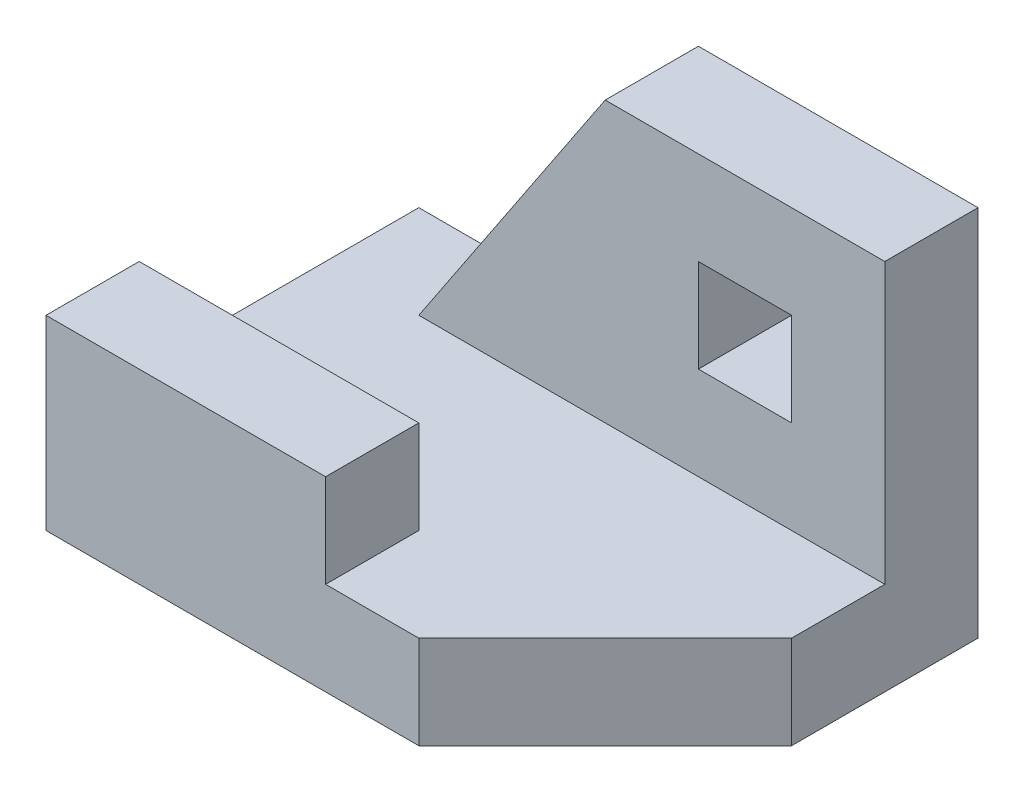
ISO-10303-21;
HEADER;
FILE_DESCRIPTION(('STEP AP214'),'2;1');
FILE_NAME('part.step','',(''),(''),'','','');
FILE_SCHEMA(('AUTOMOTIVE_DESIGN { 1 0 10303 214 1 1 1 1 }'));
ENDSEC;
DATA;
#1=APPLICATION_CONTEXT('core data for automotive mechanical design processes');
#2=APPLICATION_PROTOCOL_DEFINITION('international standard','automotive_design',2000,#1);
#3=PRODUCT_CONTEXT('',#1,'mechanical');
#4=PRODUCT('Part','Part','',(#3));
#5=PRODUCT_RELATED_PRODUCT_CATEGORY('part','',(#4));
#6=PRODUCT_DEFINITION_FORMATION('','',#4);
#7=PRODUCT_DEFINITION_CONTEXT('part definition',#1,'design');
#8=PRODUCT_DEFINITION('design','',#6,#7);
#9=PRODUCT_DEFINITION_SHAPE('','',#8);
#10=(LENGTH_UNIT() NAMED_UNIT(*) SI_UNIT(.MILLI.,.METRE.));
#11=(NAMED_UNIT(*) PLANE_ANGLE_UNIT() SI_UNIT($,.RADIAN.));
#12=(NAMED_UNIT(*) SI_UNIT($,.STERADIAN.) SOLID_ANGLE_UNIT());
#13=UNCERTAINTY_MEASURE_WITH_UNIT(LENGTH_MEASURE(1.E-05),#10,'distance_accuracy_value','');
#14=(GEOMETRIC_REPRESENTATION_CONTEXT(3) GLOBAL_UNCERTAINTY_ASSIGNED_CONTEXT((#13)) GLOBAL_UNIT_ASSIGNED_CONTEXT((#10,
#11,#12)) REPRESENTATION_CONTEXT('',''));
#15=CARTESIAN_POINT('',(0.,0.,0.));
#16=DIRECTION('',(0.,0.,1.));
#17=DIRECTION('',(1.,0.,0.));
#18=AXIS2_PLACEMENT_3D('',#15,#16,#17);
#19=CARTESIAN_POINT('',(0.,254.,-1016.));
#20=DIRECTION('',(0.,0.,-1.));
#21=DIRECTION('',(-1.,0.,0.));
#22=AXIS2_PLACEMENT_3D('',#19,#20,#21);
#23=PLANE('',#22);
#24=DIRECTION('',(-1.,0.,0.));
#25=VECTOR('',#24,1.);
#26=CARTESIAN_POINT('',(1270.,762.,-1016.));
#27=LINE('',#26,#25);
#28=CARTESIAN_POINT('',(1270.,762.,-1016.));
#29=VERTEX_POINT('',#28);
#30=CARTESIAN_POINT('',(1016.,762.,-1016.));
#31=VERTEX_POINT('',#30);
#32=EDGE_CURVE('E140',#29,#31,#27,.T.);
#33=ORIENTED_EDGE('',*,*,#32,.T.);
#34=DIRECTION('',(0.,-1.,0.));
#35=VECTOR('',#34,1.);
#36=CARTESIAN_POINT('',(1016.,762.,-1016.));
#37=LINE('',#36,#35);
#38=CARTESIAN_POINT('',(1016.,508.,-1016.));
#39=VERTEX_POINT('',#38);
#40=EDGE_CURVE('E149',#31,#39,#37,.T.);
#41=ORIENTED_EDGE('',*,*,#40,.T.);
#42=DIRECTION('',(1.,0.,0.));
#43=VECTOR('',#42,1.);
#44=CARTESIAN_POINT('',(1016.,508.,-1016.));
#45=LINE('',#44,#43);
#46=CARTESIAN_POINT('',(1270.,508.,-1016.));
#47=VERTEX_POINT('',#46);
#48=EDGE_CURVE('E47',#39,#47,#45,.T.);
#49=ORIENTED_EDGE('',*,*,#48,.T.);
#50=DIRECTION('',(0.,1.,0.));
#51=VECTOR('',#50,1.);
#52=CARTESIAN_POINT('',(1270.,508.,-1016.));
#53=LINE('',#52,#51);
#54=EDGE_CURVE('E146',#47,#29,#53,.T.);
#55=ORIENTED_EDGE('',*,*,#54,.T.);
#56=EDGE_LOOP('',(#33,#41,#49,#55));
#57=FACE_BOUND('',#56,.T.);
#58=DIRECTION('',(0.554700196225229,0.832050294337844,0.));
#59=VECTOR('',#58,1.);
#60=CARTESIAN_POINT('',(254.,254.,-1016.));
#61=LINE('',#60,#59);
#62=CARTESIAN_POINT('',(254.,254.,-1016.));
#63=VERTEX_POINT('',#62);
#64=CARTESIAN_POINT('',(762.,1016.,-1016.));
#65=VERTEX_POINT('',#64);
#66=EDGE_CURVE('E174',#63,#65,#61,.T.);
#67=ORIENTED_EDGE('',*,*,#66,.T.);
#68=DIRECTION('',(1.,0.,0.));
#69=VECTOR('',#68,1.);
#70=CARTESIAN_POINT('',(0.,1016.,-1016.));
#71=LINE('',#70,#69);
#72=CARTESIAN_POINT('',(1524.,1016.,-1016.));
#73=VERTEX_POINT('',#72);
#74=EDGE_CURVE('E186',#65,#73,#71,.T.);
#75=ORIENTED_EDGE('',*,*,#74,.T.);
#76=DIRECTION('',(0.,-1.,0.));
#77=VECTOR('',#76,1.);
#78=CARTESIAN_POINT('',(1524.,1016.,-1016.));
#79=LINE('',#78,#77);
#80=CARTESIAN_POINT('',(1524.,0.,-1016.));
#81=VERTEX_POINT('',#80);
#82=EDGE_CURVE('E188',#73,#81,#79,.T.);
#83=ORIENTED_EDGE('',*,*,#82,.T.);
#84=DIRECTION('',(1.,0.,0.));
#85=VECTOR('',#84,1.);
#86=CARTESIAN_POINT('',(0.,0.,-1016.));
#87=LINE('',#86,#85);
#88=CARTESIAN_POINT('',(0.,0.,-1016.));
#89=VERTEX_POINT('',#88);
#90=EDGE_CURVE('E218',#89,#81,#87,.T.);
#91=ORIENTED_EDGE('',*,*,#90,.F.);
#92=DIRECTION('',(0.,-1.,0.));
#93=VECTOR('',#92,1.);
#94=CARTESIAN_POINT('',(0.,254.,-1016.));
#95=LINE('',#94,#93);
#96=CARTESIAN_POINT('',(0.,254.,-1016.));
#97=VERTEX_POINT('',#96);
#98=EDGE_CURVE('E11',#97,#89,#95,.T.);
#99=ORIENTED_EDGE('',*,*,#98,.F.);
#100=DIRECTION('',(1.,0.,0.));
#101=VECTOR('',#100,1.);
#102=CARTESIAN_POINT('',(0.,254.,-1016.));
#103=LINE('',#102,#101);
#104=EDGE_CURVE('E224',#97,#63,#103,.T.);
#105=ORIENTED_EDGE('',*,*,#104,.T.);
#106=EDGE_LOOP('',(#67,#75,#83,#91,#99,#105));
#107=FACE_BOUND('',#106,.T.);
#108=ADVANCED_FACE('F33',(#57,#107),#23,.T.);
#109=CARTESIAN_POINT('',(0.,254.,0.));
#110=DIRECTION('',(-1.,0.,0.));
#111=DIRECTION('',(0.,0.,1.));
#112=AXIS2_PLACEMENT_3D('',#109,#110,#111);
#113=PLANE('',#112);
#114=DIRECTION('',(0.,0.,-1.));
#115=VECTOR('',#114,1.);
#116=CARTESIAN_POINT('',(0.,0.,0.));
#117=LINE('',#116,#115);
#118=CARTESIAN_POINT('',(0.,0.,0.));
#119=VERTEX_POINT('',#118);
#120=EDGE_CURVE('E245',#119,#89,#117,.T.);
#121=ORIENTED_EDGE('',*,*,#120,.F.);
#122=DIRECTION('',(0.,-1.,0.));
#123=VECTOR('',#122,1.);
#124=CARTESIAN_POINT('',(0.,508.,0.));
#125=LINE('',#124,#123);
#126=CARTESIAN_POINT('',(0.,508.,0.));
#127=VERTEX_POINT('',#126);
#128=EDGE_CURVE('E209',#127,#119,#125,.T.);
#129=ORIENTED_EDGE('',*,*,#128,.F.);
#130=DIRECTION('',(0.,0.,-1.));
#131=VECTOR('',#130,1.);
#132=CARTESIAN_POINT('',(0.,508.,0.));
#133=LINE('',#132,#131);
#134=CARTESIAN_POINT('',(0.,508.,-254.));
#135=VERTEX_POINT('',#134);
#136=EDGE_CURVE('E200',#127,#135,#133,.T.);
#137=ORIENTED_EDGE('',*,*,#136,.T.);
#138=DIRECTION('',(0.,-1.,0.));
#139=VECTOR('',#138,1.);
#140=CARTESIAN_POINT('',(0.,508.,-254.));
#141=LINE('',#140,#139);
#142=CARTESIAN_POINT('',(0.,254.,-254.));
#143=VERTEX_POINT('',#142);
#144=EDGE_CURVE('E212',#135,#143,#141,.T.);
#145=ORIENTED_EDGE('',*,*,#144,.T.);
#146=DIRECTION('',(0.,0.,-1.));
#147=VECTOR('',#146,1.);
#148=CARTESIAN_POINT('',(0.,254.,0.));
#149=LINE('',#148,#147);
#150=EDGE_CURVE('E227',#143,#97,#149,.T.);
#151=ORIENTED_EDGE('',*,*,#150,.T.);
#152=ORIENTED_EDGE('',*,*,#98,.T.);
#153=EDGE_LOOP('',(#121,#129,#137,#145,#151,#152));
#154=FACE_BOUND('',#153,.T.);
#155=ADVANCED_FACE('F293',(#154),#113,.T.);
#156=CARTESIAN_POINT('',(0.,254.,0.));
#157=DIRECTION('',(0.,0.,1.));
#158=DIRECTION('',(1.,0.,0.));
#159=AXIS2_PLACEMENT_3D('',#156,#157,#158);
#160=PLANE('',#159);
#161=DIRECTION('',(-1.,0.,0.));
#162=VECTOR('',#161,1.);
#163=CARTESIAN_POINT('',(0.,0.,0.));
#164=LINE('',#163,#162);
#165=CARTESIAN_POINT('',(1016.,0.,1.11022302462516E-13));
#166=VERTEX_POINT('',#165);
#167=EDGE_CURVE('E248',#166,#119,#164,.T.);
#168=ORIENTED_EDGE('',*,*,#167,.F.);
#169=DIRECTION('',(0.,-1.,0.));
#170=VECTOR('',#169,1.);
#171=CARTESIAN_POINT('',(1016.,254.,1.11022302462516E-13));
#172=LINE('',#171,#170);
#173=CARTESIAN_POINT('',(1016.,254.,1.11022302462516E-13));
#174=VERTEX_POINT('',#173);
#175=EDGE_CURVE('E40',#174,#166,#172,.T.);
#176=ORIENTED_EDGE('',*,*,#175,.F.);
#177=DIRECTION('',(-1.,0.,0.));
#178=VECTOR('',#177,1.);
#179=CARTESIAN_POINT('',(0.,254.,0.));
#180=LINE('',#179,#178);
#181=CARTESIAN_POINT('',(762.,254.,0.));
#182=VERTEX_POINT('',#181);
#183=EDGE_CURVE('E234',#174,#182,#180,.T.);
#184=ORIENTED_EDGE('',*,*,#183,.T.);
#185=DIRECTION('',(0.,-1.,0.));
#186=VECTOR('',#185,1.);
#187=CARTESIAN_POINT('',(762.,508.,0.));
#188=LINE('',#187,#186);
#189=CARTESIAN_POINT('',(762.,508.,0.));
#190=VERTEX_POINT('',#189);
#191=EDGE_CURVE('E206',#190,#182,#188,.T.);
#192=ORIENTED_EDGE('',*,*,#191,.F.);
#193=DIRECTION('',(-1.,0.,0.));
#194=VECTOR('',#193,1.);
#195=CARTESIAN_POINT('',(0.,508.,0.));
#196=LINE('',#195,#194);
#197=EDGE_CURVE('E203',#190,#127,#196,.T.);
#198=ORIENTED_EDGE('',*,*,#197,.T.);
#199=ORIENTED_EDGE('',*,*,#128,.T.);
#200=EDGE_LOOP('',(#168,#176,#184,#192,#198,#199));
#201=FACE_BOUND('',#200,.T.);
#202=ADVANCED_FACE('F262',(#201),#160,.T.);
#203=CARTESIAN_POINT('',(508.000000000003,254.,508.000000000001));
#204=DIRECTION('',(0.707106781186549,0.,0.707106781186546));
#205=DIRECTION('',(0.707106781186546,0.,-0.707106781186549));
#206=AXIS2_PLACEMENT_3D('',#203,#204,#205);
#207=PLANE('',#206);
#208=DIRECTION('',(-0.707106781186546,0.,0.707106781186549));
#209=VECTOR('',#208,1.);
#210=CARTESIAN_POINT('',(508.000000000003,0.,508.000000000001));
#211=LINE('',#210,#209);
#212=CARTESIAN_POINT('',(1524.,0.,-508.));
#213=VERTEX_POINT('',#212);
#214=EDGE_CURVE('E250',#213,#166,#211,.T.);
#215=ORIENTED_EDGE('',*,*,#214,.F.);
#216=DIRECTION('',(0.,-1.,0.));
#217=VECTOR('',#216,1.);
#218=CARTESIAN_POINT('',(1524.,254.,-508.));
#219=LINE('',#218,#217);
#220=CARTESIAN_POINT('',(1524.,254.,-508.));
#221=VERTEX_POINT('',#220);
#222=EDGE_CURVE('E243',#221,#213,#219,.T.);
#223=ORIENTED_EDGE('',*,*,#222,.F.);
#224=DIRECTION('',(-0.707106781186546,0.,0.707106781186549));
#225=VECTOR('',#224,1.);
#226=CARTESIAN_POINT('',(508.000000000003,254.,508.000000000001));
#227=LINE('',#226,#225);
#228=EDGE_CURVE('E237',#221,#174,#227,.T.);
#229=ORIENTED_EDGE('',*,*,#228,.T.);
#230=ORIENTED_EDGE('',*,*,#175,.T.);
#231=EDGE_LOOP('',(#215,#223,#229,#230));
#232=FACE_BOUND('',#231,.T.);
#233=ADVANCED_FACE('F258',(#232),#207,.T.);
#234=CARTESIAN_POINT('',(1524.,254.,0.));
#235=DIRECTION('',(1.,0.,0.));
#236=DIRECTION('',(0.,0.,-1.));
#237=AXIS2_PLACEMENT_3D('',#234,#235,#236);
#238=PLANE('',#237);
#239=DIRECTION('',(0.,0.,1.));
#240=VECTOR('',#239,1.);
#241=CARTESIAN_POINT('',(1524.,0.,0.));
#242=LINE('',#241,#240);
#243=EDGE_CURVE('E222',#81,#213,#242,.T.);
#244=ORIENTED_EDGE('',*,*,#243,.F.);
#245=ORIENTED_EDGE('',*,*,#82,.F.);
#246=DIRECTION('',(0.,0.,1.));
#247=VECTOR('',#246,1.);
#248=CARTESIAN_POINT('',(1524.,1016.,0.));
#249=LINE('',#248,#247);
#250=CARTESIAN_POINT('',(1524.,1016.,-762.));
#251=VERTEX_POINT('',#250);
#252=EDGE_CURVE('E183',#73,#251,#249,.T.);
#253=ORIENTED_EDGE('',*,*,#252,.T.);
#254=DIRECTION('',(0.,-1.,0.));
#255=VECTOR('',#254,1.);
#256=CARTESIAN_POINT('',(1524.,1016.,-762.));
#257=LINE('',#256,#255);
#258=CARTESIAN_POINT('',(1524.,254.,-762.));
#259=VERTEX_POINT('',#258);
#260=EDGE_CURVE('E191',#251,#259,#257,.T.);
#261=ORIENTED_EDGE('',*,*,#260,.T.);
#262=DIRECTION('',(0.,0.,1.));
#263=VECTOR('',#262,1.);
#264=CARTESIAN_POINT('',(1524.,254.,0.));
#265=LINE('',#264,#263);
#266=EDGE_CURVE('E240',#259,#221,#265,.T.);
#267=ORIENTED_EDGE('',*,*,#266,.T.);
#268=ORIENTED_EDGE('',*,*,#222,.T.);
#269=EDGE_LOOP('',(#244,#245,#253,#261,#267,#268));
#270=FACE_BOUND('',#269,.T.);
#271=ADVANCED_FACE('F270',(#270),#238,.T.);
#272=CARTESIAN_POINT('',(0.,254.,0.));
#273=DIRECTION('',(0.,1.,0.));
#274=DIRECTION('',(0.,0.,1.));
#275=AXIS2_PLACEMENT_3D('',#272,#273,#274);
#276=PLANE('',#275);
#277=DIRECTION('',(1.,0.,0.));
#278=VECTOR('',#277,1.);
#279=CARTESIAN_POINT('',(0.,254.,-762.));
#280=LINE('',#279,#278);
#281=CARTESIAN_POINT('',(254.,254.,-762.));
#282=VERTEX_POINT('',#281);
#283=EDGE_CURVE('E219',#282,#259,#280,.T.);
#284=ORIENTED_EDGE('',*,*,#283,.F.);
#285=DIRECTION('',(0.,0.,1.));
#286=VECTOR('',#285,1.);
#287=CARTESIAN_POINT('',(253.999999999999,254.,1.66533453693773E-13));
#288=LINE('',#287,#286);
#289=EDGE_CURVE('E221',#63,#282,#288,.T.);
#290=ORIENTED_EDGE('',*,*,#289,.F.);
#291=ORIENTED_EDGE('',*,*,#104,.F.);
#292=ORIENTED_EDGE('',*,*,#150,.F.);
#293=DIRECTION('',(1.,0.,0.));
#294=VECTOR('',#293,1.);
#295=CARTESIAN_POINT('',(0.,254.,-254.));
#296=LINE('',#295,#294);
#297=CARTESIAN_POINT('',(762.,254.,-254.));
#298=VERTEX_POINT('',#297);
#299=EDGE_CURVE('E230',#143,#298,#296,.T.);
#300=ORIENTED_EDGE('',*,*,#299,.T.);
#301=DIRECTION('',(0.,0.,1.));
#302=VECTOR('',#301,1.);
#303=CARTESIAN_POINT('',(762.,254.,0.));
#304=LINE('',#303,#302);
#305=EDGE_CURVE('E232',#298,#182,#304,.T.);
#306=ORIENTED_EDGE('',*,*,#305,.T.);
#307=ORIENTED_EDGE('',*,*,#183,.F.);
#308=ORIENTED_EDGE('',*,*,#228,.F.);
#309=ORIENTED_EDGE('',*,*,#266,.F.);
#310=EDGE_LOOP('',(#284,#290,#291,#292,#300,#306,#307,#308,#309));
#311=FACE_BOUND('',#310,.T.);
#312=ADVANCED_FACE('F281',(#311),#276,.T.);
#313=CARTESIAN_POINT('',(0.,0.,0.));
#314=DIRECTION('',(0.,1.,0.));
#315=DIRECTION('',(0.,0.,1.));
#316=AXIS2_PLACEMENT_3D('',#313,#314,#315);
#317=PLANE('',#316);
#318=ORIENTED_EDGE('',*,*,#167,.T.);
#319=ORIENTED_EDGE('',*,*,#120,.T.);
#320=ORIENTED_EDGE('',*,*,#90,.T.);
#321=ORIENTED_EDGE('',*,*,#243,.T.);
#322=ORIENTED_EDGE('',*,*,#214,.T.);
#323=EDGE_LOOP('',(#318,#319,#320,#321,#322));
#324=FACE_BOUND('',#323,.T.);
#325=ADVANCED_FACE('F265',(#324),#317,.F.);
#326=CARTESIAN_POINT('',(762.,508.,0.));
#327=DIRECTION('',(1.,0.,0.));
#328=DIRECTION('',(0.,0.,-1.));
#329=AXIS2_PLACEMENT_3D('',#326,#327,#328);
#330=PLANE('',#329);
#331=ORIENTED_EDGE('',*,*,#191,.T.);
#332=ORIENTED_EDGE('',*,*,#305,.F.);
#333=DIRECTION('',(0.,-1.,0.));
#334=VECTOR('',#333,1.);
#335=CARTESIAN_POINT('',(762.,508.,-254.));
#336=LINE('',#335,#334);
#337=CARTESIAN_POINT('',(762.,508.,-254.));
#338=VERTEX_POINT('',#337);
#339=EDGE_CURVE('E215',#338,#298,#336,.T.);
#340=ORIENTED_EDGE('',*,*,#339,.F.);
#341=DIRECTION('',(0.,0.,1.));
#342=VECTOR('',#341,1.);
#343=CARTESIAN_POINT('',(762.,508.,0.));
#344=LINE('',#343,#342);
#345=EDGE_CURVE('E194',#338,#190,#344,.T.);
#346=ORIENTED_EDGE('',*,*,#345,.T.);
#347=EDGE_LOOP('',(#331,#332,#340,#346));
#348=FACE_BOUND('',#347,.T.);
#349=ADVANCED_FACE('F285',(#348),#330,.T.);
#350=CARTESIAN_POINT('',(0.,508.,-254.));
#351=DIRECTION('',(0.,0.,-1.));
#352=DIRECTION('',(-1.,0.,0.));
#353=AXIS2_PLACEMENT_3D('',#350,#351,#352);
#354=PLANE('',#353);
#355=ORIENTED_EDGE('',*,*,#339,.T.);
#356=ORIENTED_EDGE('',*,*,#299,.F.);
#357=ORIENTED_EDGE('',*,*,#144,.F.);
#358=DIRECTION('',(1.,0.,0.));
#359=VECTOR('',#358,1.);
#360=CARTESIAN_POINT('',(0.,508.,-254.));
#361=LINE('',#360,#359);
#362=EDGE_CURVE('E197',#135,#338,#361,.T.);
#363=ORIENTED_EDGE('',*,*,#362,.T.);
#364=EDGE_LOOP('',(#355,#356,#357,#363));
#365=FACE_BOUND('',#364,.T.);
#366=ADVANCED_FACE('F308',(#365),#354,.T.);
#367=CARTESIAN_POINT('',(0.,508.,0.));
#368=DIRECTION('',(0.,1.,0.));
#369=DIRECTION('',(0.,0.,1.));
#370=AXIS2_PLACEMENT_3D('',#367,#368,#369);
#371=PLANE('',#370);
#372=ORIENTED_EDGE('',*,*,#345,.F.);
#373=ORIENTED_EDGE('',*,*,#362,.F.);
#374=ORIENTED_EDGE('',*,*,#136,.F.);
#375=ORIENTED_EDGE('',*,*,#197,.F.);
#376=EDGE_LOOP('',(#372,#373,#374,#375));
#377=FACE_BOUND('',#376,.T.);
#378=ADVANCED_FACE('F291',(#377),#371,.T.);
#379=CARTESIAN_POINT('',(0.,1016.,-762.));
#380=DIRECTION('',(0.,0.,-1.));
#381=DIRECTION('',(-1.,0.,0.));
#382=AXIS2_PLACEMENT_3D('',#379,#380,#381);
#383=PLANE('',#382);
#384=DIRECTION('',(0.,-1.,0.));
#385=VECTOR('',#384,1.);
#386=CARTESIAN_POINT('',(1016.,762.,-762.));
#387=LINE('',#386,#385);
#388=CARTESIAN_POINT('',(1016.,762.,-762.));
#389=VERTEX_POINT('',#388);
#390=CARTESIAN_POINT('',(1016.,508.,-762.));
#391=VERTEX_POINT('',#390);
#392=EDGE_CURVE('E164',#389,#391,#387,.T.);
#393=ORIENTED_EDGE('',*,*,#392,.F.);
#394=DIRECTION('',(-1.,0.,0.));
#395=VECTOR('',#394,1.);
#396=CARTESIAN_POINT('',(1270.,762.,-762.));
#397=LINE('',#396,#395);
#398=CARTESIAN_POINT('',(1270.,762.,-762.));
#399=VERTEX_POINT('',#398);
#400=EDGE_CURVE('E55',#399,#389,#397,.T.);
#401=ORIENTED_EDGE('',*,*,#400,.F.);
#402=DIRECTION('',(0.,1.,0.));
#403=VECTOR('',#402,1.);
#404=CARTESIAN_POINT('',(1270.,508.,-762.));
#405=LINE('',#404,#403);
#406=CARTESIAN_POINT('',(1270.,508.,-762.));
#407=VERTEX_POINT('',#406);
#408=EDGE_CURVE('E155',#407,#399,#405,.T.);
#409=ORIENTED_EDGE('',*,*,#408,.F.);
#410=DIRECTION('',(1.,0.,0.));
#411=VECTOR('',#410,1.);
#412=CARTESIAN_POINT('',(1016.,508.,-762.));
#413=LINE('',#412,#411);
#414=EDGE_CURVE('E158',#391,#407,#413,.T.);
#415=ORIENTED_EDGE('',*,*,#414,.F.);
#416=EDGE_LOOP('',(#393,#401,#409,#415));
#417=FACE_BOUND('',#416,.T.);
#418=DIRECTION('',(1.,0.,0.));
#419=VECTOR('',#418,1.);
#420=CARTESIAN_POINT('',(0.,1016.,-762.));
#421=LINE('',#420,#419);
#422=CARTESIAN_POINT('',(762.,1016.,-762.));
#423=VERTEX_POINT('',#422);
#424=EDGE_CURVE('E181',#423,#251,#421,.T.);
#425=ORIENTED_EDGE('',*,*,#424,.F.);
#426=DIRECTION('',(0.554700196225229,0.832050294337844,0.));
#427=VECTOR('',#426,1.);
#428=CARTESIAN_POINT('',(254.,254.,-762.));
#429=LINE('',#428,#427);
#430=EDGE_CURVE('E170',#282,#423,#429,.T.);
#431=ORIENTED_EDGE('',*,*,#430,.F.);
#432=ORIENTED_EDGE('',*,*,#283,.T.);
#433=ORIENTED_EDGE('',*,*,#260,.F.);
#434=EDGE_LOOP('',(#425,#431,#432,#433));
#435=FACE_BOUND('',#434,.T.);
#436=ADVANCED_FACE('F299',(#417,#435),#383,.F.);
#437=CARTESIAN_POINT('',(0.,1016.,0.));
#438=DIRECTION('',(0.,1.,0.));
#439=DIRECTION('',(0.,0.,1.));
#440=AXIS2_PLACEMENT_3D('',#437,#438,#439);
#441=PLANE('',#440);
#442=DIRECTION('',(0.,0.,1.));
#443=VECTOR('',#442,1.);
#444=CARTESIAN_POINT('',(762.,1016.,-1016.));
#445=LINE('',#444,#443);
#446=EDGE_CURVE('E177',#65,#423,#445,.T.);
#447=ORIENTED_EDGE('',*,*,#446,.T.);
#448=ORIENTED_EDGE('',*,*,#424,.T.);
#449=ORIENTED_EDGE('',*,*,#252,.F.);
#450=ORIENTED_EDGE('',*,*,#74,.F.);
#451=EDGE_LOOP('',(#447,#448,#449,#450));
#452=FACE_BOUND('',#451,.T.);
#453=ADVANCED_FACE('F274',(#452),#441,.T.);
#454=CARTESIAN_POINT('',(254.,254.,-1016.));
#455=DIRECTION('',(0.832050294337844,-0.554700196225229,0.));
#456=DIRECTION('',(0.554700196225229,0.832050294337844,0.));
#457=AXIS2_PLACEMENT_3D('',#454,#455,#456);
#458=PLANE('',#457);
#459=ORIENTED_EDGE('',*,*,#430,.T.);
#460=ORIENTED_EDGE('',*,*,#446,.F.);
#461=ORIENTED_EDGE('',*,*,#66,.F.);
#462=ORIENTED_EDGE('',*,*,#289,.T.);
#463=EDGE_LOOP('',(#459,#460,#461,#462));
#464=FACE_BOUND('',#463,.T.);
#465=ADVANCED_FACE('F298',(#464),#458,.F.);
#466=CARTESIAN_POINT('',(1270.,762.,-1016.));
#467=DIRECTION('',(0.,1.,0.));
#468=DIRECTION('',(-1.,0.,0.));
#469=AXIS2_PLACEMENT_3D('',#466,#467,#468);
#470=PLANE('',#469);
#471=ORIENTED_EDGE('',*,*,#400,.T.);
#472=DIRECTION('',(0.,0.,1.));
#473=VECTOR('',#472,1.);
#474=CARTESIAN_POINT('',(1016.,762.,-1016.));
#475=LINE('',#474,#473);
#476=EDGE_CURVE('E136',#31,#389,#475,.T.);
#477=ORIENTED_EDGE('',*,*,#476,.F.);
#478=ORIENTED_EDGE('',*,*,#32,.F.);
#479=DIRECTION('',(0.,0.,1.));
#480=VECTOR('',#479,1.);
#481=CARTESIAN_POINT('',(1270.,762.,-1016.));
#482=LINE('',#481,#480);
#483=EDGE_CURVE('E168',#29,#399,#482,.T.);
#484=ORIENTED_EDGE('',*,*,#483,.T.);
#485=EDGE_LOOP('',(#471,#477,#478,#484));
#486=FACE_BOUND('',#485,.T.);
#487=ADVANCED_FACE('F138',(#486),#470,.F.);
#488=CARTESIAN_POINT('',(1270.,508.,-1016.));
#489=DIRECTION('',(1.,0.,0.));
#490=DIRECTION('',(0.,1.,0.));
#491=AXIS2_PLACEMENT_3D('',#488,#489,#490);
#492=PLANE('',#491);
#493=ORIENTED_EDGE('',*,*,#408,.T.);
#494=ORIENTED_EDGE('',*,*,#483,.F.);
#495=ORIENTED_EDGE('',*,*,#54,.F.);
#496=DIRECTION('',(0.,0.,1.));
#497=VECTOR('',#496,1.);
#498=CARTESIAN_POINT('',(1270.,508.,-1016.));
#499=LINE('',#498,#497);
#500=EDGE_CURVE('E171',#47,#407,#499,.T.);
#501=ORIENTED_EDGE('',*,*,#500,.T.);
#502=EDGE_LOOP('',(#493,#494,#495,#501));
#503=FACE_BOUND('',#502,.T.);
#504=ADVANCED_FACE('F392',(#503),#492,.F.);
#505=CARTESIAN_POINT('',(1016.,508.,-1016.));
#506=DIRECTION('',(0.,-1.,0.));
#507=DIRECTION('',(0.,0.,-1.));
#508=AXIS2_PLACEMENT_3D('',#505,#506,#507);
#509=PLANE('',#508);
#510=ORIENTED_EDGE('',*,*,#414,.T.);
#511=ORIENTED_EDGE('',*,*,#500,.F.);
#512=ORIENTED_EDGE('',*,*,#48,.F.);
#513=DIRECTION('',(0.,0.,1.));
#514=VECTOR('',#513,1.);
#515=CARTESIAN_POINT('',(1016.,508.,-1016.));
#516=LINE('',#515,#514);
#517=EDGE_CURVE('E145',#39,#391,#516,.T.);
#518=ORIENTED_EDGE('',*,*,#517,.T.);
#519=EDGE_LOOP('',(#510,#511,#512,#518));
#520=FACE_BOUND('',#519,.T.);
#521=ADVANCED_FACE('F401',(#520),#509,.F.);
#522=CARTESIAN_POINT('',(1016.,762.,-1016.));
#523=DIRECTION('',(-1.,0.,0.));
#524=DIRECTION('',(0.,0.,1.));
#525=AXIS2_PLACEMENT_3D('',#522,#523,#524);
#526=PLANE('',#525);
#527=ORIENTED_EDGE('',*,*,#392,.T.);
#528=ORIENTED_EDGE('',*,*,#517,.F.);
#529=ORIENTED_EDGE('',*,*,#40,.F.);
#530=ORIENTED_EDGE('',*,*,#476,.T.);
#531=EDGE_LOOP('',(#527,#528,#529,#530));
#532=FACE_BOUND('',#531,.T.);
#533=ADVANCED_FACE('F150',(#532),#526,.F.);
#534=CLOSED_SHELL('',(#108,#155,#202,#233,#271,#312,#325,#349,#366,#378,#436,#453,#465,#487,
#504,#521,#533));
#535=MANIFOLD_SOLID_BREP('B2',#534);
#536=ADVANCED_BREP_SHAPE_REPRESENTATION('',(#18,#535),#14);
#537=SHAPE_DEFINITION_REPRESENTATION(#9,#536);
ENDSEC;
END-ISO-10303-21;
